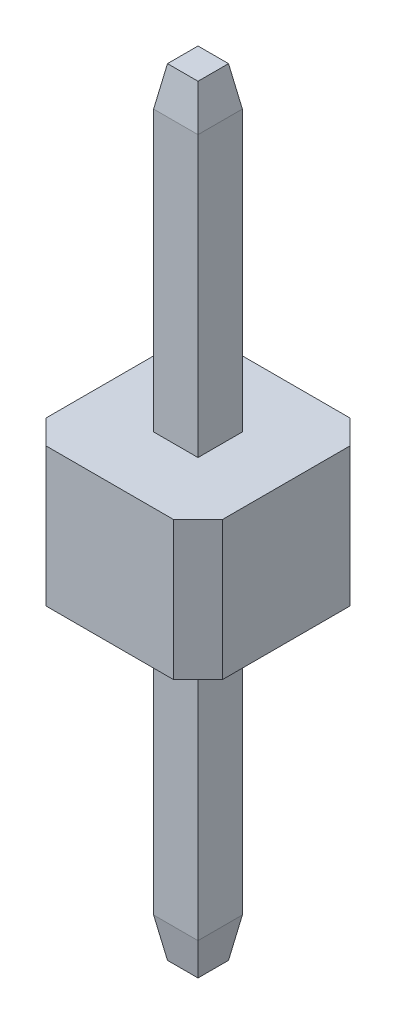
ISO-10303-21;
HEADER;
FILE_DESCRIPTION(('STEP AP214'),'2;1');
FILE_NAME('part.step','',(''),(''),'','','');
FILE_SCHEMA(('AUTOMOTIVE_DESIGN { 1 0 10303 214 1 1 1 1 }'));
ENDSEC;
DATA;
#1=APPLICATION_CONTEXT('core data for automotive mechanical design processes');
#2=APPLICATION_PROTOCOL_DEFINITION('international standard','automotive_design',2000,#1);
#3=PRODUCT_CONTEXT('',#1,'mechanical');
#4=PRODUCT('Part','Part','',(#3));
#5=PRODUCT_RELATED_PRODUCT_CATEGORY('part','',(#4));
#6=PRODUCT_DEFINITION_FORMATION('','',#4);
#7=PRODUCT_DEFINITION_CONTEXT('part definition',#1,'design');
#8=PRODUCT_DEFINITION('design','',#6,#7);
#9=PRODUCT_DEFINITION_SHAPE('','',#8);
#10=(LENGTH_UNIT() NAMED_UNIT(*) SI_UNIT(.MILLI.,.METRE.));
#11=(NAMED_UNIT(*) PLANE_ANGLE_UNIT() SI_UNIT($,.RADIAN.));
#12=(NAMED_UNIT(*) SI_UNIT($,.STERADIAN.) SOLID_ANGLE_UNIT());
#13=UNCERTAINTY_MEASURE_WITH_UNIT(LENGTH_MEASURE(1.E-05),#10,'distance_accuracy_value','');
#14=(GEOMETRIC_REPRESENTATION_CONTEXT(3) GLOBAL_UNCERTAINTY_ASSIGNED_CONTEXT((#13)) GLOBAL_UNIT_ASSIGNED_CONTEXT((#10,
#11,#12)) REPRESENTATION_CONTEXT('',''));
#15=CARTESIAN_POINT('',(0.,0.,0.));
#16=DIRECTION('',(0.,0.,1.));
#17=DIRECTION('',(1.,0.,0.));
#18=AXIS2_PLACEMENT_3D('',#15,#16,#17);
#19=CARTESIAN_POINT('',(0.,1.,0.));
#20=DIRECTION('',(0.,-1.,0.));
#21=DIRECTION('',(0.,0.,-1.));
#22=AXIS2_PLACEMENT_3D('',#19,#20,#21);
#23=PLANE('',#22);
#24=DIRECTION('',(-1.,0.,0.));
#25=VECTOR('',#24,1.);
#26=CARTESIAN_POINT('',(-0.92,1.,-1.27));
#27=LINE('',#26,#25);
#28=CARTESIAN_POINT('',(0.92,1.,-1.27));
#29=VERTEX_POINT('',#28);
#30=CARTESIAN_POINT('',(-0.92,1.,-1.27));
#31=VERTEX_POINT('',#30);
#32=EDGE_CURVE('E226',#29,#31,#27,.T.);
#33=ORIENTED_EDGE('',*,*,#32,.T.);
#34=DIRECTION('',(-0.707106781186547,0.,0.707106781186547));
#35=VECTOR('',#34,1.);
#36=CARTESIAN_POINT('',(-1.27,1.,-0.92));
#37=LINE('',#36,#35);
#38=CARTESIAN_POINT('',(-1.27,1.,-0.92));
#39=VERTEX_POINT('',#38);
#40=EDGE_CURVE('E230',#31,#39,#37,.T.);
#41=ORIENTED_EDGE('',*,*,#40,.T.);
#42=DIRECTION('',(0.,0.,1.));
#43=VECTOR('',#42,1.);
#44=CARTESIAN_POINT('',(-1.27,1.,-0.92));
#45=LINE('',#44,#43);
#46=CARTESIAN_POINT('',(-1.27,1.,0.92));
#47=VERTEX_POINT('',#46);
#48=EDGE_CURVE('E234',#39,#47,#45,.T.);
#49=ORIENTED_EDGE('',*,*,#48,.T.);
#50=DIRECTION('',(0.707106781186547,0.,0.707106781186547));
#51=VECTOR('',#50,1.);
#52=CARTESIAN_POINT('',(-1.27,1.,0.92));
#53=LINE('',#52,#51);
#54=CARTESIAN_POINT('',(-0.92,1.,1.27));
#55=VERTEX_POINT('',#54);
#56=EDGE_CURVE('E237',#47,#55,#53,.T.);
#57=ORIENTED_EDGE('',*,*,#56,.T.);
#58=DIRECTION('',(1.,0.,0.));
#59=VECTOR('',#58,1.);
#60=CARTESIAN_POINT('',(-0.92,1.,1.27));
#61=LINE('',#60,#59);
#62=CARTESIAN_POINT('',(0.92,1.,1.27));
#63=VERTEX_POINT('',#62);
#64=EDGE_CURVE('E240',#55,#63,#61,.T.);
#65=ORIENTED_EDGE('',*,*,#64,.T.);
#66=DIRECTION('',(0.707106781186547,0.,-0.707106781186547));
#67=VECTOR('',#66,1.);
#68=CARTESIAN_POINT('',(0.92,1.,1.27));
#69=LINE('',#68,#67);
#70=CARTESIAN_POINT('',(1.27,1.,0.92));
#71=VERTEX_POINT('',#70);
#72=EDGE_CURVE('E243',#63,#71,#69,.T.);
#73=ORIENTED_EDGE('',*,*,#72,.T.);
#74=DIRECTION('',(0.,0.,-1.));
#75=VECTOR('',#74,1.);
#76=CARTESIAN_POINT('',(1.27,1.,-0.92));
#77=LINE('',#76,#75);
#78=CARTESIAN_POINT('',(1.27,1.,-0.92));
#79=VERTEX_POINT('',#78);
#80=EDGE_CURVE('E246',#71,#79,#77,.T.);
#81=ORIENTED_EDGE('',*,*,#80,.T.);
#82=DIRECTION('',(-0.707106781186547,0.,-0.707106781186547));
#83=VECTOR('',#82,1.);
#84=CARTESIAN_POINT('',(0.92,1.,-1.27));
#85=LINE('',#84,#83);
#86=EDGE_CURVE('E249',#79,#29,#85,.T.);
#87=ORIENTED_EDGE('',*,*,#86,.T.);
#88=EDGE_LOOP('',(#33,#41,#49,#57,#65,#73,#81,#87));
#89=FACE_BOUND('',#88,.T.);
#90=DIRECTION('',(0.,0.,-1.));
#91=VECTOR('',#90,1.);
#92=CARTESIAN_POINT('',(0.32,1.,0.));
#93=LINE('',#92,#91);
#94=CARTESIAN_POINT('',(0.32,1.,0.32));
#95=VERTEX_POINT('',#94);
#96=CARTESIAN_POINT('',(0.32,1.,-0.32));
#97=VERTEX_POINT('',#96);
#98=EDGE_CURVE('E190',#95,#97,#93,.T.);
#99=ORIENTED_EDGE('',*,*,#98,.F.);
#100=DIRECTION('',(1.,0.,0.));
#101=VECTOR('',#100,1.);
#102=CARTESIAN_POINT('',(0.,1.,0.32));
#103=LINE('',#102,#101);
#104=CARTESIAN_POINT('',(-0.32,1.,0.32));
#105=VERTEX_POINT('',#104);
#106=EDGE_CURVE('E203',#105,#95,#103,.T.);
#107=ORIENTED_EDGE('',*,*,#106,.F.);
#108=DIRECTION('',(0.,0.,1.));
#109=VECTOR('',#108,1.);
#110=CARTESIAN_POINT('',(-0.32,1.,0.));
#111=LINE('',#110,#109);
#112=CARTESIAN_POINT('',(-0.32,1.,-0.32));
#113=VERTEX_POINT('',#112);
#114=EDGE_CURVE('E214',#113,#105,#111,.T.);
#115=ORIENTED_EDGE('',*,*,#114,.F.);
#116=DIRECTION('',(-1.,0.,0.));
#117=VECTOR('',#116,1.);
#118=CARTESIAN_POINT('',(0.,1.,-0.32));
#119=LINE('',#118,#117);
#120=EDGE_CURVE('E206',#97,#113,#119,.T.);
#121=ORIENTED_EDGE('',*,*,#120,.F.);
#122=EDGE_LOOP('',(#99,#107,#115,#121));
#123=FACE_BOUND('',#122,.T.);
#124=ADVANCED_FACE('F45',(#89,#123),#23,.F.);
#125=CARTESIAN_POINT('',(0.,-1.,0.));
#126=DIRECTION('',(0.,-1.,0.));
#127=DIRECTION('',(0.,0.,-1.));
#128=AXIS2_PLACEMENT_3D('',#125,#126,#127);
#129=PLANE('',#128);
#130=DIRECTION('',(-1.,0.,0.));
#131=VECTOR('',#130,1.);
#132=CARTESIAN_POINT('',(-0.92,-1.,-1.27));
#133=LINE('',#132,#131);
#134=CARTESIAN_POINT('',(0.92,-1.,-1.27));
#135=VERTEX_POINT('',#134);
#136=CARTESIAN_POINT('',(-0.92,-1.,-1.27));
#137=VERTEX_POINT('',#136);
#138=EDGE_CURVE('E208',#135,#137,#133,.T.);
#139=ORIENTED_EDGE('',*,*,#138,.F.);
#140=DIRECTION('',(-0.707106781186547,0.,-0.707106781186547));
#141=VECTOR('',#140,1.);
#142=CARTESIAN_POINT('',(0.92,-1.,-1.27));
#143=LINE('',#142,#141);
#144=CARTESIAN_POINT('',(1.27,-1.,-0.92));
#145=VERTEX_POINT('',#144);
#146=EDGE_CURVE('E231',#145,#135,#143,.T.);
#147=ORIENTED_EDGE('',*,*,#146,.F.);
#148=DIRECTION('',(0.,0.,-1.));
#149=VECTOR('',#148,1.);
#150=CARTESIAN_POINT('',(1.27,-1.,-0.92));
#151=LINE('',#150,#149);
#152=CARTESIAN_POINT('',(1.27,-1.,0.92));
#153=VERTEX_POINT('',#152);
#154=EDGE_CURVE('E271',#153,#145,#151,.T.);
#155=ORIENTED_EDGE('',*,*,#154,.F.);
#156=DIRECTION('',(0.707106781186547,0.,-0.707106781186547));
#157=VECTOR('',#156,1.);
#158=CARTESIAN_POINT('',(0.92,-1.,1.27));
#159=LINE('',#158,#157);
#160=CARTESIAN_POINT('',(0.92,-1.,1.27));
#161=VERTEX_POINT('',#160);
#162=EDGE_CURVE('E268',#161,#153,#159,.T.);
#163=ORIENTED_EDGE('',*,*,#162,.F.);
#164=DIRECTION('',(1.,0.,0.));
#165=VECTOR('',#164,1.);
#166=CARTESIAN_POINT('',(-0.92,-1.,1.27));
#167=LINE('',#166,#165);
#168=CARTESIAN_POINT('',(-0.92,-1.,1.27));
#169=VERTEX_POINT('',#168);
#170=EDGE_CURVE('E265',#169,#161,#167,.T.);
#171=ORIENTED_EDGE('',*,*,#170,.F.);
#172=DIRECTION('',(0.707106781186547,0.,0.707106781186547));
#173=VECTOR('',#172,1.);
#174=CARTESIAN_POINT('',(-1.27,-1.,0.92));
#175=LINE('',#174,#173);
#176=CARTESIAN_POINT('',(-1.27,-1.,0.92));
#177=VERTEX_POINT('',#176);
#178=EDGE_CURVE('E262',#177,#169,#175,.T.);
#179=ORIENTED_EDGE('',*,*,#178,.F.);
#180=DIRECTION('',(0.,0.,1.));
#181=VECTOR('',#180,1.);
#182=CARTESIAN_POINT('',(-1.27,-1.,-0.92));
#183=LINE('',#182,#181);
#184=CARTESIAN_POINT('',(-1.27,-1.,-0.92));
#185=VERTEX_POINT('',#184);
#186=EDGE_CURVE('E259',#185,#177,#183,.T.);
#187=ORIENTED_EDGE('',*,*,#186,.F.);
#188=DIRECTION('',(-0.707106781186547,0.,0.707106781186547));
#189=VECTOR('',#188,1.);
#190=CARTESIAN_POINT('',(-1.27,-1.,-0.92));
#191=LINE('',#190,#189);
#192=EDGE_CURVE('E256',#137,#185,#191,.T.);
#193=ORIENTED_EDGE('',*,*,#192,.F.);
#194=EDGE_LOOP('',(#139,#147,#155,#163,#171,#179,#187,#193));
#195=FACE_BOUND('',#194,.T.);
#196=DIRECTION('',(1.,0.,0.));
#197=VECTOR('',#196,1.);
#198=CARTESIAN_POINT('',(0.,-1.,0.32));
#199=LINE('',#198,#197);
#200=CARTESIAN_POINT('',(-0.32,-1.,0.32));
#201=VERTEX_POINT('',#200);
#202=CARTESIAN_POINT('',(0.32,-1.,0.32));
#203=VERTEX_POINT('',#202);
#204=EDGE_CURVE('E307',#201,#203,#199,.T.);
#205=ORIENTED_EDGE('',*,*,#204,.T.);
#206=DIRECTION('',(0.,0.,-1.));
#207=VECTOR('',#206,1.);
#208=CARTESIAN_POINT('',(0.32,-1.,0.));
#209=LINE('',#208,#207);
#210=CARTESIAN_POINT('',(0.32,-1.,-0.32));
#211=VERTEX_POINT('',#210);
#212=EDGE_CURVE('E319',#203,#211,#209,.T.);
#213=ORIENTED_EDGE('',*,*,#212,.T.);
#214=DIRECTION('',(-1.,0.,0.));
#215=VECTOR('',#214,1.);
#216=CARTESIAN_POINT('',(0.,-1.,-0.32));
#217=LINE('',#216,#215);
#218=CARTESIAN_POINT('',(-0.32,-1.,-0.32));
#219=VERTEX_POINT('',#218);
#220=EDGE_CURVE('E315',#211,#219,#217,.T.);
#221=ORIENTED_EDGE('',*,*,#220,.T.);
#222=DIRECTION('',(0.,0.,1.));
#223=VECTOR('',#222,1.);
#224=CARTESIAN_POINT('',(-0.32,-1.,0.));
#225=LINE('',#224,#223);
#226=EDGE_CURVE('E311',#219,#201,#225,.T.);
#227=ORIENTED_EDGE('',*,*,#226,.T.);
#228=EDGE_LOOP('',(#205,#213,#221,#227));
#229=FACE_BOUND('',#228,.T.);
#230=ADVANCED_FACE('F427',(#195,#229),#129,.T.);
#231=CARTESIAN_POINT('',(-0.92,1.,-1.27));
#232=DIRECTION('',(0.,0.,1.));
#233=DIRECTION('',(1.,0.,0.));
#234=AXIS2_PLACEMENT_3D('',#231,#232,#233);
#235=PLANE('',#234);
#236=ORIENTED_EDGE('',*,*,#138,.T.);
#237=DIRECTION('',(0.,-1.,0.));
#238=VECTOR('',#237,1.);
#239=CARTESIAN_POINT('',(-0.92,1.,-1.27));
#240=LINE('',#239,#238);
#241=EDGE_CURVE('E303',#31,#137,#240,.T.);
#242=ORIENTED_EDGE('',*,*,#241,.F.);
#243=ORIENTED_EDGE('',*,*,#32,.F.);
#244=DIRECTION('',(0.,-1.,0.));
#245=VECTOR('',#244,1.);
#246=CARTESIAN_POINT('',(0.92,1.,-1.27));
#247=LINE('',#246,#245);
#248=EDGE_CURVE('E252',#29,#135,#247,.T.);
#249=ORIENTED_EDGE('',*,*,#248,.T.);
#250=EDGE_LOOP('',(#236,#242,#243,#249));
#251=FACE_BOUND('',#250,.T.);
#252=ADVANCED_FACE('F447',(#251),#235,.F.);
#253=CARTESIAN_POINT('',(-1.27,1.,-0.92));
#254=DIRECTION('',(0.707106781186548,0.,0.707106781186548));
#255=DIRECTION('',(0.707106781186548,0.,-0.707106781186548));
#256=AXIS2_PLACEMENT_3D('',#253,#254,#255);
#257=PLANE('',#256);
#258=ORIENTED_EDGE('',*,*,#192,.T.);
#259=DIRECTION('',(0.,-1.,0.));
#260=VECTOR('',#259,1.);
#261=CARTESIAN_POINT('',(-1.27,1.,-0.92));
#262=LINE('',#261,#260);
#263=EDGE_CURVE('E299',#39,#185,#262,.T.);
#264=ORIENTED_EDGE('',*,*,#263,.F.);
#265=ORIENTED_EDGE('',*,*,#40,.F.);
#266=ORIENTED_EDGE('',*,*,#241,.T.);
#267=EDGE_LOOP('',(#258,#264,#265,#266));
#268=FACE_BOUND('',#267,.T.);
#269=ADVANCED_FACE('F474',(#268),#257,.F.);
#270=CARTESIAN_POINT('',(-1.27,1.,-0.92));
#271=DIRECTION('',(1.,0.,0.));
#272=DIRECTION('',(0.,0.,-1.));
#273=AXIS2_PLACEMENT_3D('',#270,#271,#272);
#274=PLANE('',#273);
#275=ORIENTED_EDGE('',*,*,#186,.T.);
#276=DIRECTION('',(0.,-1.,0.));
#277=VECTOR('',#276,1.);
#278=CARTESIAN_POINT('',(-1.27,1.,0.92));
#279=LINE('',#278,#277);
#280=EDGE_CURVE('E295',#47,#177,#279,.T.);
#281=ORIENTED_EDGE('',*,*,#280,.F.);
#282=ORIENTED_EDGE('',*,*,#48,.F.);
#283=ORIENTED_EDGE('',*,*,#263,.T.);
#284=EDGE_LOOP('',(#275,#281,#282,#283));
#285=FACE_BOUND('',#284,.T.);
#286=ADVANCED_FACE('F470',(#285),#274,.F.);
#287=CARTESIAN_POINT('',(-1.27,1.,0.92));
#288=DIRECTION('',(0.707106781186548,0.,-0.707106781186548));
#289=DIRECTION('',(-0.707106781186548,0.,-0.707106781186548));
#290=AXIS2_PLACEMENT_3D('',#287,#288,#289);
#291=PLANE('',#290);
#292=ORIENTED_EDGE('',*,*,#178,.T.);
#293=DIRECTION('',(0.,-1.,0.));
#294=VECTOR('',#293,1.);
#295=CARTESIAN_POINT('',(-0.92,1.,1.27));
#296=LINE('',#295,#294);
#297=EDGE_CURVE('E291',#55,#169,#296,.T.);
#298=ORIENTED_EDGE('',*,*,#297,.F.);
#299=ORIENTED_EDGE('',*,*,#56,.F.);
#300=ORIENTED_EDGE('',*,*,#280,.T.);
#301=EDGE_LOOP('',(#292,#298,#299,#300));
#302=FACE_BOUND('',#301,.T.);
#303=ADVANCED_FACE('F466',(#302),#291,.F.);
#304=CARTESIAN_POINT('',(-0.92,1.,1.27));
#305=DIRECTION('',(0.,0.,-1.));
#306=DIRECTION('',(-1.,0.,0.));
#307=AXIS2_PLACEMENT_3D('',#304,#305,#306);
#308=PLANE('',#307);
#309=ORIENTED_EDGE('',*,*,#170,.T.);
#310=DIRECTION('',(0.,-1.,0.));
#311=VECTOR('',#310,1.);
#312=CARTESIAN_POINT('',(0.92,1.,1.27));
#313=LINE('',#312,#311);
#314=EDGE_CURVE('E287',#63,#161,#313,.T.);
#315=ORIENTED_EDGE('',*,*,#314,.F.);
#316=ORIENTED_EDGE('',*,*,#64,.F.);
#317=ORIENTED_EDGE('',*,*,#297,.T.);
#318=EDGE_LOOP('',(#309,#315,#316,#317));
#319=FACE_BOUND('',#318,.T.);
#320=ADVANCED_FACE('F462',(#319),#308,.F.);
#321=CARTESIAN_POINT('',(0.92,1.,1.27));
#322=DIRECTION('',(-0.707106781186548,0.,-0.707106781186548));
#323=DIRECTION('',(-0.707106781186548,0.,0.707106781186548));
#324=AXIS2_PLACEMENT_3D('',#321,#322,#323);
#325=PLANE('',#324);
#326=ORIENTED_EDGE('',*,*,#162,.T.);
#327=DIRECTION('',(0.,-1.,0.));
#328=VECTOR('',#327,1.);
#329=CARTESIAN_POINT('',(1.27,1.,0.92));
#330=LINE('',#329,#328);
#331=EDGE_CURVE('E283',#71,#153,#330,.T.);
#332=ORIENTED_EDGE('',*,*,#331,.F.);
#333=ORIENTED_EDGE('',*,*,#72,.F.);
#334=ORIENTED_EDGE('',*,*,#314,.T.);
#335=EDGE_LOOP('',(#326,#332,#333,#334));
#336=FACE_BOUND('',#335,.T.);
#337=ADVANCED_FACE('F458',(#336),#325,.F.);
#338=CARTESIAN_POINT('',(1.27,1.,-0.92));
#339=DIRECTION('',(-1.,0.,0.));
#340=DIRECTION('',(0.,0.,1.));
#341=AXIS2_PLACEMENT_3D('',#338,#339,#340);
#342=PLANE('',#341);
#343=ORIENTED_EDGE('',*,*,#154,.T.);
#344=DIRECTION('',(0.,-1.,0.));
#345=VECTOR('',#344,1.);
#346=CARTESIAN_POINT('',(1.27,1.,-0.92));
#347=LINE('',#346,#345);
#348=EDGE_CURVE('E279',#79,#145,#347,.T.);
#349=ORIENTED_EDGE('',*,*,#348,.F.);
#350=ORIENTED_EDGE('',*,*,#80,.F.);
#351=ORIENTED_EDGE('',*,*,#331,.T.);
#352=EDGE_LOOP('',(#343,#349,#350,#351));
#353=FACE_BOUND('',#352,.T.);
#354=ADVANCED_FACE('F454',(#353),#342,.F.);
#355=CARTESIAN_POINT('',(0.92,1.,-1.27));
#356=DIRECTION('',(-0.707106781186548,0.,0.707106781186548));
#357=DIRECTION('',(0.707106781186548,0.,0.707106781186548));
#358=AXIS2_PLACEMENT_3D('',#355,#356,#357);
#359=PLANE('',#358);
#360=ORIENTED_EDGE('',*,*,#146,.T.);
#361=ORIENTED_EDGE('',*,*,#248,.F.);
#362=ORIENTED_EDGE('',*,*,#86,.F.);
#363=ORIENTED_EDGE('',*,*,#348,.T.);
#364=EDGE_LOOP('',(#360,#361,#362,#363));
#365=FACE_BOUND('',#364,.T.);
#366=ADVANCED_FACE('F451',(#365),#359,.F.);
#367=CARTESIAN_POINT('',(0.,-5.6,0.));
#368=DIRECTION('',(0.,1.,0.));
#369=DIRECTION('',(0.,0.,1.));
#370=AXIS2_PLACEMENT_3D('',#367,#368,#369);
#371=PLANE('',#370);
#372=DIRECTION('',(0.,0.,-1.));
#373=VECTOR('',#372,1.);
#374=CARTESIAN_POINT('',(-0.22,-5.6,0.));
#375=LINE('',#374,#373);
#376=CARTESIAN_POINT('',(-0.22,-5.6,0.22));
#377=VERTEX_POINT('',#376);
#378=CARTESIAN_POINT('',(-0.22,-5.6,-0.22));
#379=VERTEX_POINT('',#378);
#380=EDGE_CURVE('E351',#377,#379,#375,.T.);
#381=ORIENTED_EDGE('',*,*,#380,.T.);
#382=DIRECTION('',(1.,0.,0.));
#383=VECTOR('',#382,1.);
#384=CARTESIAN_POINT('',(0.,-5.6,-0.22));
#385=LINE('',#384,#383);
#386=CARTESIAN_POINT('',(0.22,-5.6,-0.22));
#387=VERTEX_POINT('',#386);
#388=EDGE_CURVE('E360',#379,#387,#385,.T.);
#389=ORIENTED_EDGE('',*,*,#388,.T.);
#390=DIRECTION('',(0.,0.,1.));
#391=VECTOR('',#390,1.);
#392=CARTESIAN_POINT('',(0.22,-5.6,0.));
#393=LINE('',#392,#391);
#394=CARTESIAN_POINT('',(0.22,-5.6,0.22));
#395=VERTEX_POINT('',#394);
#396=EDGE_CURVE('E357',#387,#395,#393,.T.);
#397=ORIENTED_EDGE('',*,*,#396,.T.);
#398=DIRECTION('',(-1.,0.,0.));
#399=VECTOR('',#398,1.);
#400=CARTESIAN_POINT('',(0.,-5.6,0.22));
#401=LINE('',#400,#399);
#402=EDGE_CURVE('E354',#395,#377,#401,.T.);
#403=ORIENTED_EDGE('',*,*,#402,.T.);
#404=EDGE_LOOP('',(#381,#389,#397,#403));
#405=FACE_BOUND('',#404,.T.);
#406=ADVANCED_FACE('F405',(#405),#371,.F.);
#407=CARTESIAN_POINT('',(-0.32,5.6,0.32));
#408=DIRECTION('',(0.,0.,-1.));
#409=DIRECTION('',(-1.,0.,0.));
#410=AXIS2_PLACEMENT_3D('',#407,#408,#409);
#411=PLANE('',#410);
#412=DIRECTION('',(0.,-1.,0.));
#413=VECTOR('',#412,1.);
#414=CARTESIAN_POINT('',(-0.32,5.6,0.32));
#415=LINE('',#414,#413);
#416=CARTESIAN_POINT('',(-0.32,-5.03287181803822,0.32));
#417=VERTEX_POINT('',#416);
#418=EDGE_CURVE('E196',#201,#417,#415,.T.);
#419=ORIENTED_EDGE('',*,*,#418,.T.);
#420=DIRECTION('',(1.,0.,0.));
#421=VECTOR('',#420,1.);
#422=CARTESIAN_POINT('',(-0.32,-5.03287181803822,0.32));
#423=LINE('',#422,#421);
#424=CARTESIAN_POINT('',(0.32,-5.03287181803822,0.32));
#425=VERTEX_POINT('',#424);
#426=EDGE_CURVE('E56',#417,#425,#423,.T.);
#427=ORIENTED_EDGE('',*,*,#426,.T.);
#428=DIRECTION('',(0.,-1.,0.));
#429=VECTOR('',#428,1.);
#430=CARTESIAN_POINT('',(0.32,5.6,0.32));
#431=LINE('',#430,#429);
#432=EDGE_CURVE('E197',#203,#425,#431,.T.);
#433=ORIENTED_EDGE('',*,*,#432,.F.);
#434=ORIENTED_EDGE('',*,*,#204,.F.);
#435=EDGE_LOOP('',(#419,#427,#433,#434));
#436=FACE_BOUND('',#435,.T.);
#437=ADVANCED_FACE('F425',(#436),#411,.F.);
#438=CARTESIAN_POINT('',(-0.32,5.6,-0.32));
#439=DIRECTION('',(1.,0.,0.));
#440=DIRECTION('',(0.,0.,-1.));
#441=AXIS2_PLACEMENT_3D('',#438,#439,#440);
#442=PLANE('',#441);
#443=DIRECTION('',(0.,-1.,0.));
#444=VECTOR('',#443,1.);
#445=CARTESIAN_POINT('',(-0.32,5.6,-0.32));
#446=LINE('',#445,#444);
#447=CARTESIAN_POINT('',(-0.32,-5.03287181803822,-0.32));
#448=VERTEX_POINT('',#447);
#449=EDGE_CURVE('E416',#219,#448,#446,.T.);
#450=ORIENTED_EDGE('',*,*,#449,.T.);
#451=DIRECTION('',(0.,0.,1.));
#452=VECTOR('',#451,1.);
#453=CARTESIAN_POINT('',(-0.32,-5.03287181803822,-0.32));
#454=LINE('',#453,#452);
#455=EDGE_CURVE('E11',#448,#417,#454,.T.);
#456=ORIENTED_EDGE('',*,*,#455,.T.);
#457=ORIENTED_EDGE('',*,*,#418,.F.);
#458=ORIENTED_EDGE('',*,*,#226,.F.);
#459=EDGE_LOOP('',(#450,#456,#457,#458));
#460=FACE_BOUND('',#459,.T.);
#461=ADVANCED_FACE('F418',(#460),#442,.F.);
#462=CARTESIAN_POINT('',(-0.32,5.6,-0.32));
#463=DIRECTION('',(0.,0.,1.));
#464=DIRECTION('',(1.,0.,0.));
#465=AXIS2_PLACEMENT_3D('',#462,#463,#464);
#466=PLANE('',#465);
#467=DIRECTION('',(0.,-1.,0.));
#468=VECTOR('',#467,1.);
#469=CARTESIAN_POINT('',(0.32,5.6,-0.32));
#470=LINE('',#469,#468);
#471=CARTESIAN_POINT('',(0.32,-5.03287181803822,-0.32));
#472=VERTEX_POINT('',#471);
#473=EDGE_CURVE('E220',#211,#472,#470,.T.);
#474=ORIENTED_EDGE('',*,*,#473,.T.);
#475=DIRECTION('',(-1.,0.,0.));
#476=VECTOR('',#475,1.);
#477=CARTESIAN_POINT('',(-0.32,-5.03287181803822,-0.32));
#478=LINE('',#477,#476);
#479=EDGE_CURVE('E347',#472,#448,#478,.T.);
#480=ORIENTED_EDGE('',*,*,#479,.T.);
#481=ORIENTED_EDGE('',*,*,#449,.F.);
#482=ORIENTED_EDGE('',*,*,#220,.F.);
#483=EDGE_LOOP('',(#474,#480,#481,#482));
#484=FACE_BOUND('',#483,.T.);
#485=ADVANCED_FACE('F415',(#484),#466,.F.);
#486=CARTESIAN_POINT('',(0.32,5.6,-0.32));
#487=DIRECTION('',(-1.,0.,0.));
#488=DIRECTION('',(0.,0.,1.));
#489=AXIS2_PLACEMENT_3D('',#486,#487,#488);
#490=PLANE('',#489);
#491=ORIENTED_EDGE('',*,*,#432,.T.);
#492=DIRECTION('',(0.,0.,-1.));
#493=VECTOR('',#492,1.);
#494=CARTESIAN_POINT('',(0.32,-5.03287181803822,-0.32));
#495=LINE('',#494,#493);
#496=EDGE_CURVE('E364',#425,#472,#495,.T.);
#497=ORIENTED_EDGE('',*,*,#496,.T.);
#498=ORIENTED_EDGE('',*,*,#473,.F.);
#499=ORIENTED_EDGE('',*,*,#212,.F.);
#500=EDGE_LOOP('',(#491,#497,#498,#499));
#501=FACE_BOUND('',#500,.T.);
#502=ADVANCED_FACE('F430',(#501),#490,.F.);
#503=CARTESIAN_POINT('',(0.32,5.03287181803822,-0.32));
#504=VERTEX_POINT('',#503);
#505=EDGE_CURVE('E215',#504,#97,#470,.T.);
#506=ORIENTED_EDGE('',*,*,#505,.F.);
#507=DIRECTION('',(0.,0.,1.));
#508=VECTOR('',#507,1.);
#509=CARTESIAN_POINT('',(0.32,5.03287181803822,0.32));
#510=LINE('',#509,#508);
#511=CARTESIAN_POINT('',(0.32,5.03287181803822,0.32));
#512=VERTEX_POINT('',#511);
#513=EDGE_CURVE('E192',#504,#512,#510,.T.);
#514=ORIENTED_EDGE('',*,*,#513,.T.);
#515=EDGE_CURVE('E186',#512,#95,#431,.T.);
#516=ORIENTED_EDGE('',*,*,#515,.T.);
#517=ORIENTED_EDGE('',*,*,#98,.T.);
#518=EDGE_LOOP('',(#506,#514,#516,#517));
#519=FACE_BOUND('',#518,.T.);
#520=ADVANCED_FACE('F189',(#519),#490,.F.);
#521=CARTESIAN_POINT('',(-0.32,5.03287181803822,-0.32));
#522=VERTEX_POINT('',#521);
#523=EDGE_CURVE('E420',#522,#113,#446,.T.);
#524=ORIENTED_EDGE('',*,*,#523,.F.);
#525=DIRECTION('',(1.,0.,0.));
#526=VECTOR('',#525,1.);
#527=CARTESIAN_POINT('',(0.32,5.03287181803822,-0.32));
#528=LINE('',#527,#526);
#529=EDGE_CURVE('E338',#522,#504,#528,.T.);
#530=ORIENTED_EDGE('',*,*,#529,.T.);
#531=ORIENTED_EDGE('',*,*,#505,.T.);
#532=ORIENTED_EDGE('',*,*,#120,.T.);
#533=EDGE_LOOP('',(#524,#530,#531,#532));
#534=FACE_BOUND('',#533,.T.);
#535=ADVANCED_FACE('F439',(#534),#466,.F.);
#536=CARTESIAN_POINT('',(-0.32,5.03287181803822,0.32));
#537=VERTEX_POINT('',#536);
#538=EDGE_CURVE('E212',#537,#105,#415,.T.);
#539=ORIENTED_EDGE('',*,*,#538,.F.);
#540=DIRECTION('',(0.,0.,-1.));
#541=VECTOR('',#540,1.);
#542=CARTESIAN_POINT('',(-0.32,5.03287181803822,-0.32));
#543=LINE('',#542,#541);
#544=EDGE_CURVE('E341',#537,#522,#543,.T.);
#545=ORIENTED_EDGE('',*,*,#544,.T.);
#546=ORIENTED_EDGE('',*,*,#523,.T.);
#547=ORIENTED_EDGE('',*,*,#114,.T.);
#548=EDGE_LOOP('',(#539,#545,#546,#547));
#549=FACE_BOUND('',#548,.T.);
#550=ADVANCED_FACE('F558',(#549),#442,.F.);
#551=ORIENTED_EDGE('',*,*,#515,.F.);
#552=DIRECTION('',(-1.,0.,0.));
#553=VECTOR('',#552,1.);
#554=CARTESIAN_POINT('',(-0.32,5.03287181803822,0.32));
#555=LINE('',#554,#553);
#556=EDGE_CURVE('E344',#512,#537,#555,.T.);
#557=ORIENTED_EDGE('',*,*,#556,.T.);
#558=ORIENTED_EDGE('',*,*,#538,.T.);
#559=ORIENTED_EDGE('',*,*,#106,.T.);
#560=EDGE_LOOP('',(#551,#557,#558,#559));
#561=FACE_BOUND('',#560,.T.);
#562=ADVANCED_FACE('F210',(#561),#411,.F.);
#563=CARTESIAN_POINT('',(0.,5.6,0.));
#564=DIRECTION('',(0.,1.,0.));
#565=DIRECTION('',(0.,0.,1.));
#566=AXIS2_PLACEMENT_3D('',#563,#564,#565);
#567=PLANE('',#566);
#568=DIRECTION('',(1.,0.,0.));
#569=VECTOR('',#568,1.);
#570=CARTESIAN_POINT('',(0.32,5.6,0.22));
#571=LINE('',#570,#569);
#572=CARTESIAN_POINT('',(-0.22,5.6,0.22));
#573=VERTEX_POINT('',#572);
#574=CARTESIAN_POINT('',(0.22,5.6,0.22));
#575=VERTEX_POINT('',#574);
#576=EDGE_CURVE('E323',#573,#575,#571,.T.);
#577=ORIENTED_EDGE('',*,*,#576,.T.);
#578=DIRECTION('',(0.,0.,-1.));
#579=VECTOR('',#578,1.);
#580=CARTESIAN_POINT('',(0.22,5.6,-0.32));
#581=LINE('',#580,#579);
#582=CARTESIAN_POINT('',(0.22,5.6,-0.22));
#583=VERTEX_POINT('',#582);
#584=EDGE_CURVE('E332',#575,#583,#581,.T.);
#585=ORIENTED_EDGE('',*,*,#584,.T.);
#586=DIRECTION('',(-1.,0.,0.));
#587=VECTOR('',#586,1.);
#588=CARTESIAN_POINT('',(-0.32,5.6,-0.22));
#589=LINE('',#588,#587);
#590=CARTESIAN_POINT('',(-0.22,5.6,-0.22));
#591=VERTEX_POINT('',#590);
#592=EDGE_CURVE('E329',#583,#591,#589,.T.);
#593=ORIENTED_EDGE('',*,*,#592,.T.);
#594=DIRECTION('',(0.,0.,1.));
#595=VECTOR('',#594,1.);
#596=CARTESIAN_POINT('',(-0.22,5.6,0.32));
#597=LINE('',#596,#595);
#598=EDGE_CURVE('E326',#591,#573,#597,.T.);
#599=ORIENTED_EDGE('',*,*,#598,.T.);
#600=EDGE_LOOP('',(#577,#585,#593,#599));
#601=FACE_BOUND('',#600,.T.);
#602=ADVANCED_FACE('F509',(#601),#567,.T.);
#603=CARTESIAN_POINT('',(-0.22,5.6,0.));
#604=DIRECTION('',(-0.984807753012209,0.173648177666927,0.));
#605=DIRECTION('',(0.,0.,-1.));
#606=AXIS2_PLACEMENT_3D('',#603,#604,#605);
#607=PLANE('',#606);
#608=DIRECTION('',(-0.171087869746033,-0.970287525247815,-0.171087869746033));
#609=VECTOR('',#608,1.);
#610=CARTESIAN_POINT('',(-0.213560366981668,5.63652097366188,-0.213560366981668));
#611=LINE('',#610,#609);
#612=EDGE_CURVE('E375',#522,#591,#611,.F.);
#613=ORIENTED_EDGE('',*,*,#612,.F.);
#614=ORIENTED_EDGE('',*,*,#544,.F.);
#615=DIRECTION('',(-0.171087869746033,-0.970287525247815,0.171087869746033));
#616=VECTOR('',#615,1.);
#617=CARTESIAN_POINT('',(-0.213560366981668,5.63652097366188,0.213560366981668));
#618=LINE('',#617,#616);
#619=EDGE_CURVE('E379',#573,#537,#618,.T.);
#620=ORIENTED_EDGE('',*,*,#619,.F.);
#621=ORIENTED_EDGE('',*,*,#598,.F.);
#622=EDGE_LOOP('',(#613,#614,#620,#621));
#623=FACE_BOUND('',#622,.T.);
#624=ADVANCED_FACE('F503',(#623),#607,.T.);
#625=CARTESIAN_POINT('',(0.,5.6,0.22));
#626=DIRECTION('',(0.,0.173648177666927,0.984807753012209));
#627=DIRECTION('',(-1.,0.,0.));
#628=AXIS2_PLACEMENT_3D('',#625,#626,#627);
#629=PLANE('',#628);
#630=ORIENTED_EDGE('',*,*,#619,.T.);
#631=ORIENTED_EDGE('',*,*,#556,.F.);
#632=DIRECTION('',(-0.171087869746033,0.970287525247815,-0.171087869746033));
#633=VECTOR('',#632,1.);
#634=CARTESIAN_POINT('',(0.213560366981668,5.63652097366188,0.213560366981668));
#635=LINE('',#634,#633);
#636=EDGE_CURVE('E372',#575,#512,#635,.F.);
#637=ORIENTED_EDGE('',*,*,#636,.F.);
#638=ORIENTED_EDGE('',*,*,#576,.F.);
#639=EDGE_LOOP('',(#630,#631,#637,#638));
#640=FACE_BOUND('',#639,.T.);
#641=ADVANCED_FACE('F496',(#640),#629,.T.);
#642=CARTESIAN_POINT('',(0.,5.6,-0.22));
#643=DIRECTION('',(0.,0.173648177666927,-0.984807753012209));
#644=DIRECTION('',(1.,0.,0.));
#645=AXIS2_PLACEMENT_3D('',#642,#643,#644);
#646=PLANE('',#645);
#647=ORIENTED_EDGE('',*,*,#612,.T.);
#648=ORIENTED_EDGE('',*,*,#592,.F.);
#649=DIRECTION('',(0.171087869746033,-0.970287525247815,-0.171087869746033));
#650=VECTOR('',#649,1.);
#651=CARTESIAN_POINT('',(0.213560366981668,5.63652097366188,-0.213560366981668));
#652=LINE('',#651,#650);
#653=EDGE_CURVE('E369',#504,#583,#652,.F.);
#654=ORIENTED_EDGE('',*,*,#653,.F.);
#655=ORIENTED_EDGE('',*,*,#529,.F.);
#656=EDGE_LOOP('',(#647,#648,#654,#655));
#657=FACE_BOUND('',#656,.T.);
#658=ADVANCED_FACE('F489',(#657),#646,.T.);
#659=CARTESIAN_POINT('',(0.22,5.6,0.));
#660=DIRECTION('',(0.984807753012209,0.173648177666927,0.));
#661=DIRECTION('',(0.,0.,1.));
#662=AXIS2_PLACEMENT_3D('',#659,#660,#661);
#663=PLANE('',#662);
#664=ORIENTED_EDGE('',*,*,#636,.T.);
#665=ORIENTED_EDGE('',*,*,#513,.F.);
#666=ORIENTED_EDGE('',*,*,#653,.T.);
#667=ORIENTED_EDGE('',*,*,#584,.F.);
#668=EDGE_LOOP('',(#664,#665,#666,#667));
#669=FACE_BOUND('',#668,.T.);
#670=ADVANCED_FACE('F483',(#669),#663,.T.);
#671=CARTESIAN_POINT('',(-0.32,-5.03287181803822,0.32));
#672=DIRECTION('',(0.,0.173648177666927,-0.984807753012209));
#673=DIRECTION('',(1.,0.,0.));
#674=AXIS2_PLACEMENT_3D('',#671,#672,#673);
#675=PLANE('',#674);
#676=DIRECTION('',(-0.171087869746033,0.970287525247815,0.171087869746033));
#677=VECTOR('',#676,1.);
#678=CARTESIAN_POINT('',(-0.301266522128489,-5.13911465050913,0.301266522128489));
#679=LINE('',#678,#677);
#680=EDGE_CURVE('E388',#377,#417,#679,.T.);
#681=ORIENTED_EDGE('',*,*,#680,.F.);
#682=ORIENTED_EDGE('',*,*,#402,.F.);
#683=DIRECTION('',(0.171087869746033,0.970287525247815,0.171087869746033));
#684=VECTOR('',#683,1.);
#685=CARTESIAN_POINT('',(0.30126652212849,-5.13911465050913,0.301266522128489));
#686=LINE('',#685,#684);
#687=EDGE_CURVE('E50',#425,#395,#686,.F.);
#688=ORIENTED_EDGE('',*,*,#687,.F.);
#689=ORIENTED_EDGE('',*,*,#426,.F.);
#690=EDGE_LOOP('',(#681,#682,#688,#689));
#691=FACE_BOUND('',#690,.T.);
#692=ADVANCED_FACE('F48',(#691),#675,.F.);
#693=CARTESIAN_POINT('',(0.32,-5.03287181803822,-0.32));
#694=DIRECTION('',(-0.984807753012209,0.173648177666927,0.));
#695=DIRECTION('',(0.,0.,-1.));
#696=AXIS2_PLACEMENT_3D('',#693,#694,#695);
#697=PLANE('',#696);
#698=ORIENTED_EDGE('',*,*,#687,.T.);
#699=ORIENTED_EDGE('',*,*,#396,.F.);
#700=DIRECTION('',(0.171087869746033,0.970287525247815,-0.171087869746033));
#701=VECTOR('',#700,1.);
#702=CARTESIAN_POINT('',(0.32,-5.03287181803822,-0.32));
#703=LINE('',#702,#701);
#704=EDGE_CURVE('E386',#472,#387,#703,.F.);
#705=ORIENTED_EDGE('',*,*,#704,.F.);
#706=ORIENTED_EDGE('',*,*,#496,.F.);
#707=EDGE_LOOP('',(#698,#699,#705,#706));
#708=FACE_BOUND('',#707,.T.);
#709=ADVANCED_FACE('F400',(#708),#697,.F.);
#710=CARTESIAN_POINT('',(-0.32,-5.03287181803822,-0.32));
#711=DIRECTION('',(0.984807753012209,0.173648177666927,0.));
#712=DIRECTION('',(0.,0.,1.));
#713=AXIS2_PLACEMENT_3D('',#710,#711,#712);
#714=PLANE('',#713);
#715=ORIENTED_EDGE('',*,*,#680,.T.);
#716=ORIENTED_EDGE('',*,*,#455,.F.);
#717=DIRECTION('',(0.171087869746033,-0.970287525247815,0.171087869746033));
#718=VECTOR('',#717,1.);
#719=CARTESIAN_POINT('',(-0.32,-5.03287181803822,-0.32));
#720=LINE('',#719,#718);
#721=EDGE_CURVE('E383',#379,#448,#720,.F.);
#722=ORIENTED_EDGE('',*,*,#721,.F.);
#723=ORIENTED_EDGE('',*,*,#380,.F.);
#724=EDGE_LOOP('',(#715,#716,#722,#723));
#725=FACE_BOUND('',#724,.T.);
#726=ADVANCED_FACE('F411',(#725),#714,.F.);
#727=CARTESIAN_POINT('',(-0.32,-5.03287181803822,-0.32));
#728=DIRECTION('',(0.,0.173648177666927,0.984807753012209));
#729=DIRECTION('',(-1.,0.,0.));
#730=AXIS2_PLACEMENT_3D('',#727,#728,#729);
#731=PLANE('',#730);
#732=ORIENTED_EDGE('',*,*,#704,.T.);
#733=ORIENTED_EDGE('',*,*,#388,.F.);
#734=ORIENTED_EDGE('',*,*,#721,.T.);
#735=ORIENTED_EDGE('',*,*,#479,.F.);
#736=EDGE_LOOP('',(#732,#733,#734,#735));
#737=FACE_BOUND('',#736,.T.);
#738=ADVANCED_FACE('F409',(#737),#731,.F.);
#739=CLOSED_SHELL('',(#124,#230,#252,#269,#286,#303,#320,#337,#354,#366,#406,#437,#461,#485,
#502,#520,#535,#550,#562,#602,#624,#641,#658,#670,#692,#709,#726,#738));
#740=MANIFOLD_SOLID_BREP('B2',#739);
#741=ADVANCED_BREP_SHAPE_REPRESENTATION('',(#18,#740),#14);
#742=SHAPE_DEFINITION_REPRESENTATION(#9,#741);
ENDSEC;
END-ISO-10303-21;
